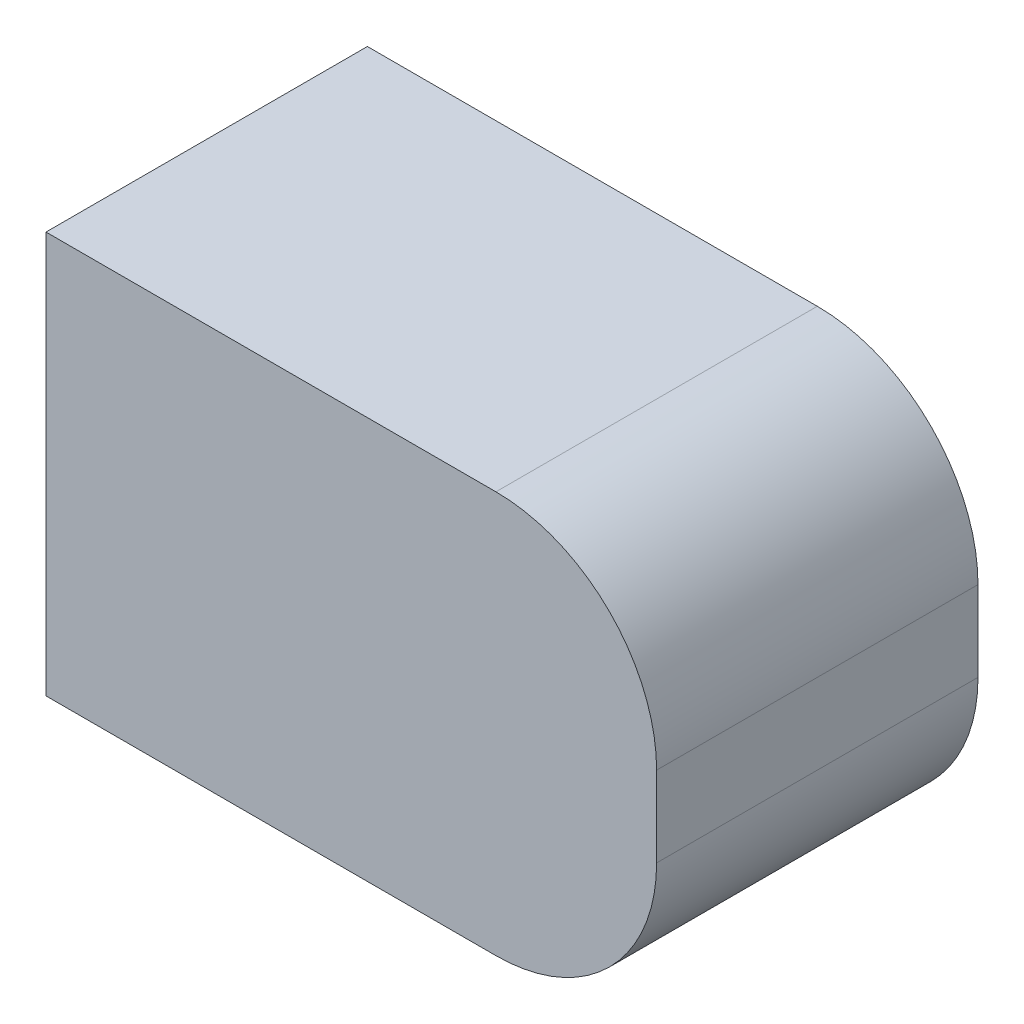
ISO-10303-21;
HEADER;
FILE_DESCRIPTION(('STEP AP214'),'2;1');
FILE_NAME('part.step','',(''),(''),'','','');
FILE_SCHEMA(('AUTOMOTIVE_DESIGN { 1 0 10303 214 1 1 1 1 }'));
ENDSEC;
DATA;
#1=APPLICATION_CONTEXT('core data for automotive mechanical design processes');
#2=APPLICATION_PROTOCOL_DEFINITION('international standard','automotive_design',2000,#1);
#3=PRODUCT_CONTEXT('',#1,'mechanical');
#4=PRODUCT('Part','Part','',(#3));
#5=PRODUCT_RELATED_PRODUCT_CATEGORY('part','',(#4));
#6=PRODUCT_DEFINITION_FORMATION('','',#4);
#7=PRODUCT_DEFINITION_CONTEXT('part definition',#1,'design');
#8=PRODUCT_DEFINITION('design','',#6,#7);
#9=PRODUCT_DEFINITION_SHAPE('','',#8);
#10=(LENGTH_UNIT() NAMED_UNIT(*) SI_UNIT(.MILLI.,.METRE.));
#11=(NAMED_UNIT(*) PLANE_ANGLE_UNIT() SI_UNIT($,.RADIAN.));
#12=(NAMED_UNIT(*) SI_UNIT($,.STERADIAN.) SOLID_ANGLE_UNIT());
#13=UNCERTAINTY_MEASURE_WITH_UNIT(LENGTH_MEASURE(1.E-05),#10,'distance_accuracy_value','');
#14=(GEOMETRIC_REPRESENTATION_CONTEXT(3) GLOBAL_UNCERTAINTY_ASSIGNED_CONTEXT((#13)) GLOBAL_UNIT_ASSIGNED_CONTEXT((#10,
#11,#12)) REPRESENTATION_CONTEXT('',''));
#15=CARTESIAN_POINT('',(0.,0.,0.));
#16=DIRECTION('',(0.,0.,1.));
#17=DIRECTION('',(1.,0.,0.));
#18=AXIS2_PLACEMENT_3D('',#15,#16,#17);
#19=CARTESIAN_POINT('',(-1.223,0.525,0.));
#20=DIRECTION('',(0.,0.,1.));
#21=DIRECTION('',(0.707106781186548,0.707106781186547,0.));
#22=AXIS2_PLACEMENT_3D('',#19,#20,#21);
#23=CYLINDRICAL_SURFACE('',#22,0.1);
#24=CARTESIAN_POINT('',(-1.223,0.525,0.2));
#25=DIRECTION('',(0.,0.,-1.));
#26=DIRECTION('',(0.707106781186548,0.707106781186547,0.));
#27=AXIS2_PLACEMENT_3D('',#24,#25,#26);
#28=CIRCLE('',#27,0.1);
#29=CARTESIAN_POINT('',(-1.223,0.625,0.2));
#30=VERTEX_POINT('',#29);
#31=CARTESIAN_POINT('',(-1.123,0.525,0.2));
#32=VERTEX_POINT('',#31);
#33=EDGE_CURVE('E11',#30,#32,#28,.T.);
#34=ORIENTED_EDGE('',*,*,#33,.T.);
#35=DIRECTION('',(0.,0.,-1.));
#36=VECTOR('',#35,1.);
#37=CARTESIAN_POINT('',(-1.123,0.525,0.));
#38=LINE('',#37,#36);
#39=CARTESIAN_POINT('',(-1.123,0.525,0.));
#40=VERTEX_POINT('',#39);
#41=EDGE_CURVE('E24',#32,#40,#38,.T.);
#42=ORIENTED_EDGE('',*,*,#41,.T.);
#43=CARTESIAN_POINT('',(-1.223,0.525,0.));
#44=DIRECTION('',(0.,0.,1.));
#45=DIRECTION('',(0.707106781186548,0.707106781186547,0.));
#46=AXIS2_PLACEMENT_3D('',#43,#44,#45);
#47=CIRCLE('',#46,0.1);
#48=CARTESIAN_POINT('',(-1.223,0.625,0.));
#49=VERTEX_POINT('',#48);
#50=EDGE_CURVE('E115',#40,#49,#47,.T.);
#51=ORIENTED_EDGE('',*,*,#50,.T.);
#52=DIRECTION('',(0.,0.,1.));
#53=VECTOR('',#52,1.);
#54=CARTESIAN_POINT('',(-1.223,0.625,0.));
#55=LINE('',#54,#53);
#56=EDGE_CURVE('E113',#49,#30,#55,.T.);
#57=ORIENTED_EDGE('',*,*,#56,.T.);
#58=EDGE_LOOP('',(#34,#42,#51,#57));
#59=FACE_BOUND('',#58,.T.);
#60=ADVANCED_FACE('F17',(#59),#23,.T.);
#61=CARTESIAN_POINT('',(-1.313,0.5,0.));
#62=DIRECTION('',(0.,0.,1.));
#63=DIRECTION('',(1.,0.,0.));
#64=AXIS2_PLACEMENT_3D('',#61,#62,#63);
#65=PLANE('',#64);
#66=ORIENTED_EDGE('',*,*,#50,.F.);
#67=DIRECTION('',(0.,1.,0.));
#68=VECTOR('',#67,1.);
#69=CARTESIAN_POINT('',(-1.123,0.375,0.));
#70=LINE('',#69,#68);
#71=CARTESIAN_POINT('',(-1.123,0.475000000000014,0.));
#72=VERTEX_POINT('',#71);
#73=EDGE_CURVE('E110',#72,#40,#70,.T.);
#74=ORIENTED_EDGE('',*,*,#73,.F.);
#75=CARTESIAN_POINT('',(-1.223,0.475000000000014,0.));
#76=DIRECTION('',(0.,0.,1.));
#77=DIRECTION('',(0.707106781186565,-0.70710678118653,0.));
#78=AXIS2_PLACEMENT_3D('',#75,#76,#77);
#79=CIRCLE('',#78,0.1);
#80=CARTESIAN_POINT('',(-1.223,0.375000000000014,0.));
#81=VERTEX_POINT('',#80);
#82=EDGE_CURVE('E107',#81,#72,#79,.T.);
#83=ORIENTED_EDGE('',*,*,#82,.F.);
#84=DIRECTION('',(1.,0.,0.));
#85=VECTOR('',#84,1.);
#86=CARTESIAN_POINT('',(-1.503,0.375,0.));
#87=LINE('',#86,#85);
#88=CARTESIAN_POINT('',(-1.503,0.375,0.));
#89=VERTEX_POINT('',#88);
#90=EDGE_CURVE('E105',#89,#81,#87,.T.);
#91=ORIENTED_EDGE('',*,*,#90,.F.);
#92=DIRECTION('',(0.,-1.,0.));
#93=VECTOR('',#92,1.);
#94=CARTESIAN_POINT('',(-1.503,0.625,0.));
#95=LINE('',#94,#93);
#96=CARTESIAN_POINT('',(-1.503,0.625,0.));
#97=VERTEX_POINT('',#96);
#98=EDGE_CURVE('E84',#97,#89,#95,.T.);
#99=ORIENTED_EDGE('',*,*,#98,.F.);
#100=DIRECTION('',(-1.,0.,0.));
#101=VECTOR('',#100,1.);
#102=CARTESIAN_POINT('',(-1.123,0.625,0.));
#103=LINE('',#102,#101);
#104=EDGE_CURVE('E101',#49,#97,#103,.T.);
#105=ORIENTED_EDGE('',*,*,#104,.F.);
#106=EDGE_LOOP('',(#66,#74,#83,#91,#99,#105));
#107=FACE_BOUND('',#106,.T.);
#108=ADVANCED_FACE('F121',(#107),#65,.F.);
#109=CARTESIAN_POINT('',(-1.123,0.375,0.));
#110=DIRECTION('',(1.,0.,0.));
#111=DIRECTION('',(0.,1.,0.));
#112=AXIS2_PLACEMENT_3D('',#109,#110,#111);
#113=PLANE('',#112);
#114=ORIENTED_EDGE('',*,*,#41,.F.);
#115=DIRECTION('',(0.,1.,0.));
#116=VECTOR('',#115,1.);
#117=CARTESIAN_POINT('',(-1.123,0.375,0.2));
#118=LINE('',#117,#116);
#119=CARTESIAN_POINT('',(-1.123,0.475000000000014,0.2));
#120=VERTEX_POINT('',#119);
#121=EDGE_CURVE('E99',#120,#32,#118,.T.);
#122=ORIENTED_EDGE('',*,*,#121,.F.);
#123=DIRECTION('',(0.,0.,1.));
#124=VECTOR('',#123,1.);
#125=CARTESIAN_POINT('',(-1.123,0.475000000000014,0.));
#126=LINE('',#125,#124);
#127=EDGE_CURVE('E96',#72,#120,#126,.T.);
#128=ORIENTED_EDGE('',*,*,#127,.F.);
#129=ORIENTED_EDGE('',*,*,#73,.T.);
#130=EDGE_LOOP('',(#114,#122,#128,#129));
#131=FACE_BOUND('',#130,.T.);
#132=ADVANCED_FACE('F123',(#131),#113,.T.);
#133=CARTESIAN_POINT('',(-1.223,0.475000000000014,0.));
#134=DIRECTION('',(0.,0.,1.));
#135=DIRECTION('',(0.707106781186565,-0.70710678118653,0.));
#136=AXIS2_PLACEMENT_3D('',#133,#134,#135);
#137=CYLINDRICAL_SURFACE('',#136,0.1);
#138=CARTESIAN_POINT('',(-1.223,0.475000000000014,0.2));
#139=DIRECTION('',(0.,0.,-1.));
#140=DIRECTION('',(0.707106781186565,-0.70710678118653,0.));
#141=AXIS2_PLACEMENT_3D('',#138,#139,#140);
#142=CIRCLE('',#141,0.1);
#143=CARTESIAN_POINT('',(-1.223,0.375000000000014,0.2));
#144=VERTEX_POINT('',#143);
#145=EDGE_CURVE('E94',#120,#144,#142,.T.);
#146=ORIENTED_EDGE('',*,*,#145,.T.);
#147=DIRECTION('',(0.,0.,-1.));
#148=VECTOR('',#147,1.);
#149=CARTESIAN_POINT('',(-1.223,0.375000000000014,0.));
#150=LINE('',#149,#148);
#151=EDGE_CURVE('E73',#144,#81,#150,.T.);
#152=ORIENTED_EDGE('',*,*,#151,.T.);
#153=ORIENTED_EDGE('',*,*,#82,.T.);
#154=ORIENTED_EDGE('',*,*,#127,.T.);
#155=EDGE_LOOP('',(#146,#152,#153,#154));
#156=FACE_BOUND('',#155,.T.);
#157=ADVANCED_FACE('F125',(#156),#137,.T.);
#158=CARTESIAN_POINT('',(-1.123,0.625,0.));
#159=DIRECTION('',(0.,1.,0.));
#160=DIRECTION('',(-1.,0.,0.));
#161=AXIS2_PLACEMENT_3D('',#158,#159,#160);
#162=PLANE('',#161);
#163=ORIENTED_EDGE('',*,*,#56,.F.);
#164=ORIENTED_EDGE('',*,*,#104,.T.);
#165=DIRECTION('',(0.,0.,1.));
#166=VECTOR('',#165,1.);
#167=CARTESIAN_POINT('',(-1.503,0.625,0.));
#168=LINE('',#167,#166);
#169=CARTESIAN_POINT('',(-1.503,0.625,0.2));
#170=VERTEX_POINT('',#169);
#171=EDGE_CURVE('E91',#97,#170,#168,.T.);
#172=ORIENTED_EDGE('',*,*,#171,.T.);
#173=DIRECTION('',(-1.,0.,0.));
#174=VECTOR('',#173,1.);
#175=CARTESIAN_POINT('',(-1.123,0.625,0.2));
#176=LINE('',#175,#174);
#177=EDGE_CURVE('E76',#30,#170,#176,.T.);
#178=ORIENTED_EDGE('',*,*,#177,.F.);
#179=EDGE_LOOP('',(#163,#164,#172,#178));
#180=FACE_BOUND('',#179,.T.);
#181=ADVANCED_FACE('F127',(#180),#162,.T.);
#182=CARTESIAN_POINT('',(-1.503,0.375,0.));
#183=DIRECTION('',(0.,-1.,0.));
#184=DIRECTION('',(1.,0.,0.));
#185=AXIS2_PLACEMENT_3D('',#182,#183,#184);
#186=PLANE('',#185);
#187=ORIENTED_EDGE('',*,*,#151,.F.);
#188=DIRECTION('',(1.,0.,0.));
#189=VECTOR('',#188,1.);
#190=CARTESIAN_POINT('',(-1.503,0.375,0.2));
#191=LINE('',#190,#189);
#192=CARTESIAN_POINT('',(-1.503,0.375,0.2));
#193=VERTEX_POINT('',#192);
#194=EDGE_CURVE('E67',#193,#144,#191,.T.);
#195=ORIENTED_EDGE('',*,*,#194,.F.);
#196=DIRECTION('',(0.,0.,1.));
#197=VECTOR('',#196,1.);
#198=CARTESIAN_POINT('',(-1.503,0.375,0.));
#199=LINE('',#198,#197);
#200=EDGE_CURVE('E71',#89,#193,#199,.T.);
#201=ORIENTED_EDGE('',*,*,#200,.F.);
#202=ORIENTED_EDGE('',*,*,#90,.T.);
#203=EDGE_LOOP('',(#187,#195,#201,#202));
#204=FACE_BOUND('',#203,.T.);
#205=ADVANCED_FACE('F69',(#204),#186,.T.);
#206=CARTESIAN_POINT('',(-1.503,0.625,0.));
#207=DIRECTION('',(-1.,0.,0.));
#208=DIRECTION('',(0.,-1.,0.));
#209=AXIS2_PLACEMENT_3D('',#206,#207,#208);
#210=PLANE('',#209);
#211=ORIENTED_EDGE('',*,*,#98,.T.);
#212=ORIENTED_EDGE('',*,*,#200,.T.);
#213=DIRECTION('',(0.,-1.,0.));
#214=VECTOR('',#213,1.);
#215=CARTESIAN_POINT('',(-1.503,0.625,0.2));
#216=LINE('',#215,#214);
#217=EDGE_CURVE('E83',#170,#193,#216,.T.);
#218=ORIENTED_EDGE('',*,*,#217,.F.);
#219=ORIENTED_EDGE('',*,*,#171,.F.);
#220=EDGE_LOOP('',(#211,#212,#218,#219));
#221=FACE_BOUND('',#220,.T.);
#222=ADVANCED_FACE('F81',(#221),#210,.T.);
#223=CARTESIAN_POINT('',(-1.313,0.5,0.2));
#224=DIRECTION('',(0.,0.,1.));
#225=DIRECTION('',(1.,0.,0.));
#226=AXIS2_PLACEMENT_3D('',#223,#224,#225);
#227=PLANE('',#226);
#228=ORIENTED_EDGE('',*,*,#33,.F.);
#229=ORIENTED_EDGE('',*,*,#177,.T.);
#230=ORIENTED_EDGE('',*,*,#217,.T.);
#231=ORIENTED_EDGE('',*,*,#194,.T.);
#232=ORIENTED_EDGE('',*,*,#145,.F.);
#233=ORIENTED_EDGE('',*,*,#121,.T.);
#234=EDGE_LOOP('',(#228,#229,#230,#231,#232,#233));
#235=FACE_BOUND('',#234,.T.);
#236=ADVANCED_FACE('F86',(#235),#227,.T.);
#237=CLOSED_SHELL('',(#60,#108,#132,#157,#181,#205,#222,#236));
#238=MANIFOLD_SOLID_BREP('B1',#237);
#239=ADVANCED_BREP_SHAPE_REPRESENTATION('',(#18,#238),#14);
#240=SHAPE_DEFINITION_REPRESENTATION(#9,#239);
ENDSEC;
END-ISO-10303-21;
